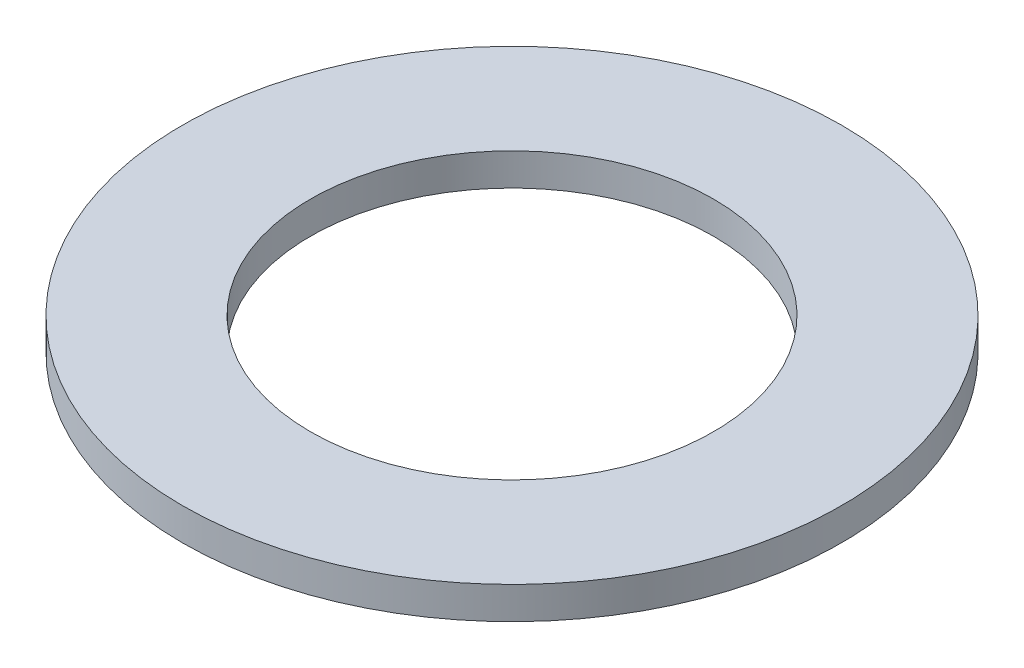
ISO-10303-21;
HEADER;
FILE_DESCRIPTION(('STEP AP214'),'2;1');
FILE_NAME('part.step','',(''),(''),'','','');
FILE_SCHEMA(('AUTOMOTIVE_DESIGN { 1 0 10303 214 1 1 1 1 }'));
ENDSEC;
DATA;
#1=APPLICATION_CONTEXT('core data for automotive mechanical design processes');
#2=APPLICATION_PROTOCOL_DEFINITION('international standard','automotive_design',2000,#1);
#3=PRODUCT_CONTEXT('',#1,'mechanical');
#4=PRODUCT('Part','Part','',(#3));
#5=PRODUCT_RELATED_PRODUCT_CATEGORY('part','',(#4));
#6=PRODUCT_DEFINITION_FORMATION('','',#4);
#7=PRODUCT_DEFINITION_CONTEXT('part definition',#1,'design');
#8=PRODUCT_DEFINITION('design','',#6,#7);
#9=PRODUCT_DEFINITION_SHAPE('','',#8);
#10=(LENGTH_UNIT() NAMED_UNIT(*) SI_UNIT(.MILLI.,.METRE.));
#11=(NAMED_UNIT(*) PLANE_ANGLE_UNIT() SI_UNIT($,.RADIAN.));
#12=(NAMED_UNIT(*) SI_UNIT($,.STERADIAN.) SOLID_ANGLE_UNIT());
#13=UNCERTAINTY_MEASURE_WITH_UNIT(LENGTH_MEASURE(1.E-05),#10,'distance_accuracy_value','');
#14=(GEOMETRIC_REPRESENTATION_CONTEXT(3) GLOBAL_UNCERTAINTY_ASSIGNED_CONTEXT((#13)) GLOBAL_UNIT_ASSIGNED_CONTEXT((#10,
#11,#12)) REPRESENTATION_CONTEXT('',''));
#15=CARTESIAN_POINT('',(0.,0.,0.));
#16=DIRECTION('',(0.,0.,1.));
#17=DIRECTION('',(1.,0.,0.));
#18=AXIS2_PLACEMENT_3D('',#15,#16,#17);
#19=CARTESIAN_POINT('',(0.,0.8,0.));
#20=DIRECTION('',(0.,-1.,0.));
#21=DIRECTION('',(0.,0.,-1.));
#22=AXIS2_PLACEMENT_3D('',#19,#20,#21);
#23=CYLINDRICAL_SURFACE('',#22,5.);
#24=CARTESIAN_POINT('',(0.,0.8,0.));
#25=DIRECTION('',(0.,1.,0.));
#26=DIRECTION('',(0.,0.,1.));
#27=AXIS2_PLACEMENT_3D('',#24,#25,#26);
#28=CIRCLE('',#27,5.);
#29=CARTESIAN_POINT('',(0.,0.8,5.));
#30=VERTEX_POINT('',#29);
#31=EDGE_CURVE('E49',#30,#30,#28,.T.);
#32=ORIENTED_EDGE('',*,*,#31,.T.);
#33=EDGE_LOOP('',(#32));
#34=FACE_BOUND('',#33,.T.);
#35=CARTESIAN_POINT('',(0.,0.,0.));
#36=DIRECTION('',(0.,1.,0.));
#37=DIRECTION('',(0.,0.,1.));
#38=AXIS2_PLACEMENT_3D('',#35,#36,#37);
#39=CIRCLE('',#38,5.);
#40=CARTESIAN_POINT('',(0.,0.,5.));
#41=VERTEX_POINT('',#40);
#42=EDGE_CURVE('E56',#41,#41,#39,.T.);
#43=ORIENTED_EDGE('',*,*,#42,.F.);
#44=EDGE_LOOP('',(#43));
#45=FACE_BOUND('',#44,.T.);
#46=ADVANCED_FACE('F41',(#34,#45),#23,.F.);
#47=CARTESIAN_POINT('',(0.,0.8,0.));
#48=DIRECTION('',(0.,-1.,0.));
#49=DIRECTION('',(0.,0.,-1.));
#50=AXIS2_PLACEMENT_3D('',#47,#48,#49);
#51=CYLINDRICAL_SURFACE('',#50,8.175);
#52=CARTESIAN_POINT('',(0.,0.8,0.));
#53=DIRECTION('',(0.,1.,0.));
#54=DIRECTION('',(0.,0.,1.));
#55=AXIS2_PLACEMENT_3D('',#52,#53,#54);
#56=CIRCLE('',#55,8.175);
#57=CARTESIAN_POINT('',(0.,0.8,8.175));
#58=VERTEX_POINT('',#57);
#59=EDGE_CURVE('E10',#58,#58,#56,.T.);
#60=ORIENTED_EDGE('',*,*,#59,.F.);
#61=EDGE_LOOP('',(#60));
#62=FACE_BOUND('',#61,.T.);
#63=CARTESIAN_POINT('',(0.,0.,0.));
#64=DIRECTION('',(0.,1.,0.));
#65=DIRECTION('',(0.,0.,1.));
#66=AXIS2_PLACEMENT_3D('',#63,#64,#65);
#67=CIRCLE('',#66,8.175);
#68=CARTESIAN_POINT('',(0.,0.,8.175));
#69=VERTEX_POINT('',#68);
#70=EDGE_CURVE('E44',#69,#69,#67,.T.);
#71=ORIENTED_EDGE('',*,*,#70,.T.);
#72=EDGE_LOOP('',(#71));
#73=FACE_BOUND('',#72,.T.);
#74=ADVANCED_FACE('F65',(#62,#73),#51,.T.);
#75=CARTESIAN_POINT('',(0.,0.8,0.));
#76=DIRECTION('',(0.,1.,0.));
#77=DIRECTION('',(0.,0.,1.));
#78=AXIS2_PLACEMENT_3D('',#75,#76,#77);
#79=PLANE('',#78);
#80=ORIENTED_EDGE('',*,*,#31,.F.);
#81=EDGE_LOOP('',(#80));
#82=FACE_BOUND('',#81,.T.);
#83=ORIENTED_EDGE('',*,*,#59,.T.);
#84=EDGE_LOOP('',(#83));
#85=FACE_BOUND('',#84,.T.);
#86=ADVANCED_FACE('F69',(#82,#85),#79,.T.);
#87=CARTESIAN_POINT('',(0.,0.,0.));
#88=DIRECTION('',(0.,1.,0.));
#89=DIRECTION('',(0.,0.,1.));
#90=AXIS2_PLACEMENT_3D('',#87,#88,#89);
#91=PLANE('',#90);
#92=ORIENTED_EDGE('',*,*,#42,.T.);
#93=EDGE_LOOP('',(#92));
#94=FACE_BOUND('',#93,.T.);
#95=ORIENTED_EDGE('',*,*,#70,.F.);
#96=EDGE_LOOP('',(#95));
#97=FACE_BOUND('',#96,.T.);
#98=ADVANCED_FACE('F67',(#94,#97),#91,.F.);
#99=CLOSED_SHELL('',(#46,#74,#86,#98));
#100=MANIFOLD_SOLID_BREP('B2',#99);
#101=ADVANCED_BREP_SHAPE_REPRESENTATION('',(#18,#100),#14);
#102=SHAPE_DEFINITION_REPRESENTATION(#9,#101);
ENDSEC;
END-ISO-10303-21;
